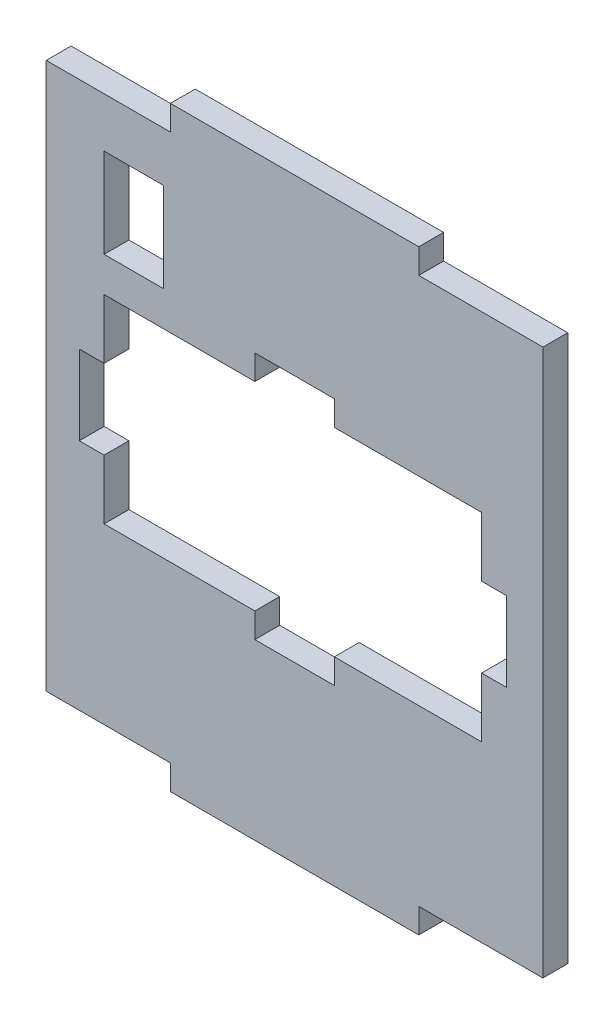
ISO-10303-21;
HEADER;
FILE_DESCRIPTION(('STEP AP214'),'2;1');
FILE_NAME('part.step','',(''),(''),'','','');
FILE_SCHEMA(('AUTOMOTIVE_DESIGN { 1 0 10303 214 1 1 1 1 }'));
ENDSEC;
DATA;
#1=APPLICATION_CONTEXT('core data for automotive mechanical design processes');
#2=APPLICATION_PROTOCOL_DEFINITION('international standard','automotive_design',2000,#1);
#3=PRODUCT_CONTEXT('',#1,'mechanical');
#4=PRODUCT('Part','Part','',(#3));
#5=PRODUCT_RELATED_PRODUCT_CATEGORY('part','',(#4));
#6=PRODUCT_DEFINITION_FORMATION('','',#4);
#7=PRODUCT_DEFINITION_CONTEXT('part definition',#1,'design');
#8=PRODUCT_DEFINITION('design','',#6,#7);
#9=PRODUCT_DEFINITION_SHAPE('','',#8);
#10=(LENGTH_UNIT() NAMED_UNIT(*) SI_UNIT(.MILLI.,.METRE.));
#11=(NAMED_UNIT(*) PLANE_ANGLE_UNIT() SI_UNIT($,.RADIAN.));
#12=(NAMED_UNIT(*) SI_UNIT($,.STERADIAN.) SOLID_ANGLE_UNIT());
#13=UNCERTAINTY_MEASURE_WITH_UNIT(LENGTH_MEASURE(1.E-05),#10,'distance_accuracy_value','');
#14=(GEOMETRIC_REPRESENTATION_CONTEXT(3) GLOBAL_UNCERTAINTY_ASSIGNED_CONTEXT((#13)) GLOBAL_UNIT_ASSIGNED_CONTEXT((#10,
#11,#12)) REPRESENTATION_CONTEXT('',''));
#15=CARTESIAN_POINT('',(0.,0.,0.));
#16=DIRECTION('',(0.,0.,1.));
#17=DIRECTION('',(1.,0.,0.));
#18=AXIS2_PLACEMENT_3D('',#15,#16,#17);
#19=CARTESIAN_POINT('',(0.,0.,5.));
#20=DIRECTION('',(0.,0.,1.));
#21=DIRECTION('',(1.,0.,0.));
#22=AXIS2_PLACEMENT_3D('',#19,#20,#21);
#23=PLANE('',#22);
#24=DIRECTION('',(0.,1.,0.));
#25=VECTOR('',#24,1.);
#26=CARTESIAN_POINT('',(25.,60.,5.));
#27=LINE('',#26,#25);
#28=CARTESIAN_POINT('',(25.,55.,5.));
#29=VERTEX_POINT('',#28);
#30=CARTESIAN_POINT('',(25.,60.,5.));
#31=VERTEX_POINT('',#30);
#32=EDGE_CURVE('E450',#29,#31,#27,.T.);
#33=ORIENTED_EDGE('',*,*,#32,.T.);
#34=DIRECTION('',(-1.,0.,0.));
#35=VECTOR('',#34,1.);
#36=CARTESIAN_POINT('',(-25.,60.,5.));
#37=LINE('',#36,#35);
#38=CARTESIAN_POINT('',(-25.,60.,5.));
#39=VERTEX_POINT('',#38);
#40=EDGE_CURVE('E453',#31,#39,#37,.T.);
#41=ORIENTED_EDGE('',*,*,#40,.T.);
#42=DIRECTION('',(0.,-1.,0.));
#43=VECTOR('',#42,1.);
#44=CARTESIAN_POINT('',(-25.,55.,5.));
#45=LINE('',#44,#43);
#46=CARTESIAN_POINT('',(-25.,55.,5.));
#47=VERTEX_POINT('',#46);
#48=EDGE_CURVE('E456',#39,#47,#45,.T.);
#49=ORIENTED_EDGE('',*,*,#48,.T.);
#50=DIRECTION('',(-1.,0.,0.));
#51=VECTOR('',#50,1.);
#52=CARTESIAN_POINT('',(-50.,55.,5.));
#53=LINE('',#52,#51);
#54=CARTESIAN_POINT('',(-50.,55.,5.));
#55=VERTEX_POINT('',#54);
#56=EDGE_CURVE('E458',#47,#55,#53,.T.);
#57=ORIENTED_EDGE('',*,*,#56,.T.);
#58=DIRECTION('',(0.,-1.,0.));
#59=VECTOR('',#58,1.);
#60=CARTESIAN_POINT('',(-50.,55.,5.));
#61=LINE('',#60,#59);
#62=CARTESIAN_POINT('',(-50.,-55.,5.));
#63=VERTEX_POINT('',#62);
#64=EDGE_CURVE('E460',#55,#63,#61,.T.);
#65=ORIENTED_EDGE('',*,*,#64,.T.);
#66=DIRECTION('',(1.,0.,0.));
#67=VECTOR('',#66,1.);
#68=CARTESIAN_POINT('',(-50.,-55.,5.));
#69=LINE('',#68,#67);
#70=CARTESIAN_POINT('',(-25.,-55.,5.));
#71=VERTEX_POINT('',#70);
#72=EDGE_CURVE('E462',#63,#71,#69,.T.);
#73=ORIENTED_EDGE('',*,*,#72,.T.);
#74=DIRECTION('',(0.,-1.,0.));
#75=VECTOR('',#74,1.);
#76=CARTESIAN_POINT('',(-25.,-60.,5.));
#77=LINE('',#76,#75);
#78=CARTESIAN_POINT('',(-25.,-60.,5.));
#79=VERTEX_POINT('',#78);
#80=EDGE_CURVE('E464',#71,#79,#77,.T.);
#81=ORIENTED_EDGE('',*,*,#80,.T.);
#82=DIRECTION('',(1.,0.,0.));
#83=VECTOR('',#82,1.);
#84=CARTESIAN_POINT('',(-25.,-60.,5.));
#85=LINE('',#84,#83);
#86=CARTESIAN_POINT('',(25.,-60.,5.));
#87=VERTEX_POINT('',#86);
#88=EDGE_CURVE('E466',#79,#87,#85,.T.);
#89=ORIENTED_EDGE('',*,*,#88,.T.);
#90=DIRECTION('',(0.,1.,0.));
#91=VECTOR('',#90,1.);
#92=CARTESIAN_POINT('',(25.,-55.,5.));
#93=LINE('',#92,#91);
#94=CARTESIAN_POINT('',(25.,-55.,5.));
#95=VERTEX_POINT('',#94);
#96=EDGE_CURVE('E468',#87,#95,#93,.T.);
#97=ORIENTED_EDGE('',*,*,#96,.T.);
#98=DIRECTION('',(1.,0.,0.));
#99=VECTOR('',#98,1.);
#100=CARTESIAN_POINT('',(25.,-55.,5.));
#101=LINE('',#100,#99);
#102=CARTESIAN_POINT('',(50.,-55.,5.));
#103=VERTEX_POINT('',#102);
#104=EDGE_CURVE('E470',#95,#103,#101,.T.);
#105=ORIENTED_EDGE('',*,*,#104,.T.);
#106=DIRECTION('',(0.,1.,0.));
#107=VECTOR('',#106,1.);
#108=CARTESIAN_POINT('',(50.,55.,5.));
#109=LINE('',#108,#107);
#110=CARTESIAN_POINT('',(50.,55.,5.));
#111=VERTEX_POINT('',#110);
#112=EDGE_CURVE('E472',#103,#111,#109,.T.);
#113=ORIENTED_EDGE('',*,*,#112,.T.);
#114=DIRECTION('',(-1.,0.,0.));
#115=VECTOR('',#114,1.);
#116=CARTESIAN_POINT('',(25.,55.,5.));
#117=LINE('',#116,#115);
#118=EDGE_CURVE('E474',#111,#29,#117,.T.);
#119=ORIENTED_EDGE('',*,*,#118,.T.);
#120=EDGE_LOOP('',(#33,#41,#49,#57,#65,#73,#81,#89,#97,#105,#113,#119));
#121=FACE_BOUND('',#120,.T.);
#122=DIRECTION('',(0.,1.,0.));
#123=VECTOR('',#122,1.);
#124=CARTESIAN_POINT('',(37.6511627906977,-8.,5.));
#125=LINE('',#124,#123);
#126=CARTESIAN_POINT('',(37.6511627906977,-20.,5.));
#127=VERTEX_POINT('',#126);
#128=CARTESIAN_POINT('',(37.6511627906977,-8.,5.));
#129=VERTEX_POINT('',#128);
#130=EDGE_CURVE('E309',#127,#129,#125,.T.);
#131=ORIENTED_EDGE('',*,*,#130,.F.);
#132=DIRECTION('',(1.,0.,0.));
#133=VECTOR('',#132,1.);
#134=CARTESIAN_POINT('',(8.00000000000001,-20.,5.));
#135=LINE('',#134,#133);
#136=CARTESIAN_POINT('',(8.00000000000001,-20.,5.));
#137=VERTEX_POINT('',#136);
#138=EDGE_CURVE('E307',#137,#127,#135,.T.);
#139=ORIENTED_EDGE('',*,*,#138,.F.);
#140=DIRECTION('',(0.,1.,0.));
#141=VECTOR('',#140,1.);
#142=CARTESIAN_POINT('',(8.,-25.,5.));
#143=LINE('',#142,#141);
#144=CARTESIAN_POINT('',(8.,-25.,5.));
#145=VERTEX_POINT('',#144);
#146=EDGE_CURVE('E347',#145,#137,#143,.T.);
#147=ORIENTED_EDGE('',*,*,#146,.F.);
#148=DIRECTION('',(1.,0.,0.));
#149=VECTOR('',#148,1.);
#150=CARTESIAN_POINT('',(-8.,-25.,5.));
#151=LINE('',#150,#149);
#152=CARTESIAN_POINT('',(-8.,-25.,5.));
#153=VERTEX_POINT('',#152);
#154=EDGE_CURVE('E344',#153,#145,#151,.T.);
#155=ORIENTED_EDGE('',*,*,#154,.F.);
#156=DIRECTION('',(0.,-1.,0.));
#157=VECTOR('',#156,1.);
#158=CARTESIAN_POINT('',(-8.,-20.,5.));
#159=LINE('',#158,#157);
#160=CARTESIAN_POINT('',(-8.,-20.,5.));
#161=VERTEX_POINT('',#160);
#162=EDGE_CURVE('E342',#161,#153,#159,.T.);
#163=ORIENTED_EDGE('',*,*,#162,.F.);
#164=DIRECTION('',(1.,0.,0.));
#165=VECTOR('',#164,1.);
#166=CARTESIAN_POINT('',(-38.3488372093023,-20.,5.));
#167=LINE('',#166,#165);
#168=CARTESIAN_POINT('',(-38.3488372093023,-20.,5.));
#169=VERTEX_POINT('',#168);
#170=EDGE_CURVE('E340',#169,#161,#167,.T.);
#171=ORIENTED_EDGE('',*,*,#170,.F.);
#172=DIRECTION('',(0.,-1.,0.));
#173=VECTOR('',#172,1.);
#174=CARTESIAN_POINT('',(-38.3488372093023,-8.,5.));
#175=LINE('',#174,#173);
#176=CARTESIAN_POINT('',(-38.3488372093023,-8.,5.));
#177=VERTEX_POINT('',#176);
#178=EDGE_CURVE('E338',#177,#169,#175,.T.);
#179=ORIENTED_EDGE('',*,*,#178,.F.);
#180=DIRECTION('',(1.,0.,0.));
#181=VECTOR('',#180,1.);
#182=CARTESIAN_POINT('',(-43.3488372093023,-8.,5.));
#183=LINE('',#182,#181);
#184=CARTESIAN_POINT('',(-43.3488372093023,-8.,5.));
#185=VERTEX_POINT('',#184);
#186=EDGE_CURVE('E336',#185,#177,#183,.T.);
#187=ORIENTED_EDGE('',*,*,#186,.F.);
#188=DIRECTION('',(0.,-1.,0.));
#189=VECTOR('',#188,1.);
#190=CARTESIAN_POINT('',(-43.3488372093023,8.,5.));
#191=LINE('',#190,#189);
#192=CARTESIAN_POINT('',(-43.3488372093023,8.,5.));
#193=VERTEX_POINT('',#192);
#194=EDGE_CURVE('E334',#193,#185,#191,.T.);
#195=ORIENTED_EDGE('',*,*,#194,.F.);
#196=DIRECTION('',(-1.,0.,0.));
#197=VECTOR('',#196,1.);
#198=CARTESIAN_POINT('',(-38.3488372093023,8.,5.));
#199=LINE('',#198,#197);
#200=CARTESIAN_POINT('',(-38.3488372093023,8.,5.));
#201=VERTEX_POINT('',#200);
#202=EDGE_CURVE('E332',#201,#193,#199,.T.);
#203=ORIENTED_EDGE('',*,*,#202,.F.);
#204=DIRECTION('',(0.,-1.,0.));
#205=VECTOR('',#204,1.);
#206=CARTESIAN_POINT('',(-38.3488372093023,20.,5.));
#207=LINE('',#206,#205);
#208=CARTESIAN_POINT('',(-38.3488372093023,20.,5.));
#209=VERTEX_POINT('',#208);
#210=EDGE_CURVE('E330',#209,#201,#207,.T.);
#211=ORIENTED_EDGE('',*,*,#210,.F.);
#212=DIRECTION('',(-1.,0.,0.));
#213=VECTOR('',#212,1.);
#214=CARTESIAN_POINT('',(-38.3488372093023,20.,5.));
#215=LINE('',#214,#213);
#216=CARTESIAN_POINT('',(-8.,20.,5.));
#217=VERTEX_POINT('',#216);
#218=EDGE_CURVE('E328',#217,#209,#215,.T.);
#219=ORIENTED_EDGE('',*,*,#218,.F.);
#220=DIRECTION('',(0.,-1.,0.));
#221=VECTOR('',#220,1.);
#222=CARTESIAN_POINT('',(-8.,20.,5.));
#223=LINE('',#222,#221);
#224=CARTESIAN_POINT('',(-8.,25.,5.));
#225=VERTEX_POINT('',#224);
#226=EDGE_CURVE('E326',#225,#217,#223,.T.);
#227=ORIENTED_EDGE('',*,*,#226,.F.);
#228=DIRECTION('',(-1.,0.,0.));
#229=VECTOR('',#228,1.);
#230=CARTESIAN_POINT('',(-8.,25.,5.));
#231=LINE('',#230,#229);
#232=CARTESIAN_POINT('',(8.00000000000001,25.,5.));
#233=VERTEX_POINT('',#232);
#234=EDGE_CURVE('E324',#233,#225,#231,.T.);
#235=ORIENTED_EDGE('',*,*,#234,.F.);
#236=DIRECTION('',(0.,1.,0.));
#237=VECTOR('',#236,1.);
#238=CARTESIAN_POINT('',(8.00000000000001,25.,5.));
#239=LINE('',#238,#237);
#240=CARTESIAN_POINT('',(8.00000000000001,20.,5.));
#241=VERTEX_POINT('',#240);
#242=EDGE_CURVE('E322',#241,#233,#239,.T.);
#243=ORIENTED_EDGE('',*,*,#242,.F.);
#244=DIRECTION('',(-1.,0.,0.));
#245=VECTOR('',#244,1.);
#246=CARTESIAN_POINT('',(8.00000000000001,20.,5.));
#247=LINE('',#246,#245);
#248=CARTESIAN_POINT('',(37.6511627906977,20.,5.));
#249=VERTEX_POINT('',#248);
#250=EDGE_CURVE('E320',#249,#241,#247,.T.);
#251=ORIENTED_EDGE('',*,*,#250,.F.);
#252=DIRECTION('',(0.,1.,0.));
#253=VECTOR('',#252,1.);
#254=CARTESIAN_POINT('',(37.6511627906977,20.,5.));
#255=LINE('',#254,#253);
#256=CARTESIAN_POINT('',(37.6511627906977,8.,5.));
#257=VERTEX_POINT('',#256);
#258=EDGE_CURVE('E318',#257,#249,#255,.T.);
#259=ORIENTED_EDGE('',*,*,#258,.F.);
#260=DIRECTION('',(-1.,0.,0.));
#261=VECTOR('',#260,1.);
#262=CARTESIAN_POINT('',(37.6511627906977,8.,5.));
#263=LINE('',#262,#261);
#264=CARTESIAN_POINT('',(42.6511627906977,8.,5.));
#265=VERTEX_POINT('',#264);
#266=EDGE_CURVE('E316',#265,#257,#263,.T.);
#267=ORIENTED_EDGE('',*,*,#266,.F.);
#268=DIRECTION('',(0.,1.,0.));
#269=VECTOR('',#268,1.);
#270=CARTESIAN_POINT('',(42.6511627906977,8.,5.));
#271=LINE('',#270,#269);
#272=CARTESIAN_POINT('',(42.6511627906977,-8.,5.));
#273=VERTEX_POINT('',#272);
#274=EDGE_CURVE('E314',#273,#265,#271,.T.);
#275=ORIENTED_EDGE('',*,*,#274,.F.);
#276=DIRECTION('',(1.,0.,0.));
#277=VECTOR('',#276,1.);
#278=CARTESIAN_POINT('',(42.6511627906977,-8.,5.));
#279=LINE('',#278,#277);
#280=EDGE_CURVE('E312',#129,#273,#279,.T.);
#281=ORIENTED_EDGE('',*,*,#280,.F.);
#282=EDGE_LOOP('',(#131,#139,#147,#155,#163,#171,#179,#187,#195,#203,#211,#219,#227,#235,#243,
#251,#259,#267,#275,#281));
#283=FACE_BOUND('',#282,.T.);
#284=DIRECTION('',(0.,-1.,0.));
#285=VECTOR('',#284,1.);
#286=CARTESIAN_POINT('',(-38.3488372093023,45.,5.));
#287=LINE('',#286,#285);
#288=CARTESIAN_POINT('',(-38.3488372093023,45.,5.));
#289=VERTEX_POINT('',#288);
#290=CARTESIAN_POINT('',(-38.3488372093023,27.,5.));
#291=VERTEX_POINT('',#290);
#292=EDGE_CURVE('E279',#289,#291,#287,.T.);
#293=ORIENTED_EDGE('',*,*,#292,.F.);
#294=DIRECTION('',(-1.,0.,0.));
#295=VECTOR('',#294,1.);
#296=CARTESIAN_POINT('',(-26.3488372093023,45.,5.));
#297=LINE('',#296,#295);
#298=CARTESIAN_POINT('',(-26.3488372093023,45.,5.));
#299=VERTEX_POINT('',#298);
#300=EDGE_CURVE('E271',#299,#289,#297,.T.);
#301=ORIENTED_EDGE('',*,*,#300,.F.);
#302=DIRECTION('',(0.,1.,0.));
#303=VECTOR('',#302,1.);
#304=CARTESIAN_POINT('',(-26.3488372093023,27.,5.));
#305=LINE('',#304,#303);
#306=CARTESIAN_POINT('',(-26.3488372093023,27.,5.));
#307=VERTEX_POINT('',#306);
#308=EDGE_CURVE('E293',#307,#299,#305,.T.);
#309=ORIENTED_EDGE('',*,*,#308,.F.);
#310=DIRECTION('',(1.,0.,0.));
#311=VECTOR('',#310,1.);
#312=CARTESIAN_POINT('',(-38.3488372093023,27.,5.));
#313=LINE('',#312,#311);
#314=EDGE_CURVE('E291',#291,#307,#313,.T.);
#315=ORIENTED_EDGE('',*,*,#314,.F.);
#316=EDGE_LOOP('',(#293,#301,#309,#315));
#317=FACE_BOUND('',#316,.T.);
#318=ADVANCED_FACE('F38',(#121,#283,#317),#23,.T.);
#319=CARTESIAN_POINT('',(0.,0.,0.));
#320=DIRECTION('',(0.,0.,1.));
#321=DIRECTION('',(1.,0.,0.));
#322=AXIS2_PLACEMENT_3D('',#319,#320,#321);
#323=PLANE('',#322);
#324=DIRECTION('',(1.,0.,0.));
#325=VECTOR('',#324,1.);
#326=CARTESIAN_POINT('',(8.00000000000001,-20.,0.));
#327=LINE('',#326,#325);
#328=CARTESIAN_POINT('',(8.00000000000001,-20.,0.));
#329=VERTEX_POINT('',#328);
#330=CARTESIAN_POINT('',(37.6511627906977,-20.,0.));
#331=VERTEX_POINT('',#330);
#332=EDGE_CURVE('E287',#329,#331,#327,.T.);
#333=ORIENTED_EDGE('',*,*,#332,.T.);
#334=DIRECTION('',(0.,1.,0.));
#335=VECTOR('',#334,1.);
#336=CARTESIAN_POINT('',(37.6511627906977,-8.,0.));
#337=LINE('',#336,#335);
#338=CARTESIAN_POINT('',(37.6511627906977,-8.,0.));
#339=VERTEX_POINT('',#338);
#340=EDGE_CURVE('E352',#331,#339,#337,.T.);
#341=ORIENTED_EDGE('',*,*,#340,.T.);
#342=DIRECTION('',(1.,0.,0.));
#343=VECTOR('',#342,1.);
#344=CARTESIAN_POINT('',(42.6511627906977,-8.,0.));
#345=LINE('',#344,#343);
#346=CARTESIAN_POINT('',(42.6511627906977,-8.,0.));
#347=VERTEX_POINT('',#346);
#348=EDGE_CURVE('E355',#339,#347,#345,.T.);
#349=ORIENTED_EDGE('',*,*,#348,.T.);
#350=DIRECTION('',(0.,1.,0.));
#351=VECTOR('',#350,1.);
#352=CARTESIAN_POINT('',(42.6511627906977,8.,0.));
#353=LINE('',#352,#351);
#354=CARTESIAN_POINT('',(42.6511627906977,8.,0.));
#355=VERTEX_POINT('',#354);
#356=EDGE_CURVE('E358',#347,#355,#353,.T.);
#357=ORIENTED_EDGE('',*,*,#356,.T.);
#358=DIRECTION('',(-1.,0.,0.));
#359=VECTOR('',#358,1.);
#360=CARTESIAN_POINT('',(37.6511627906977,8.,0.));
#361=LINE('',#360,#359);
#362=CARTESIAN_POINT('',(37.6511627906977,8.,0.));
#363=VERTEX_POINT('',#362);
#364=EDGE_CURVE('E361',#355,#363,#361,.T.);
#365=ORIENTED_EDGE('',*,*,#364,.T.);
#366=DIRECTION('',(0.,1.,0.));
#367=VECTOR('',#366,1.);
#368=CARTESIAN_POINT('',(37.6511627906977,20.,0.));
#369=LINE('',#368,#367);
#370=CARTESIAN_POINT('',(37.6511627906977,20.,0.));
#371=VERTEX_POINT('',#370);
#372=EDGE_CURVE('E364',#363,#371,#369,.T.);
#373=ORIENTED_EDGE('',*,*,#372,.T.);
#374=DIRECTION('',(-1.,0.,0.));
#375=VECTOR('',#374,1.);
#376=CARTESIAN_POINT('',(8.00000000000001,20.,0.));
#377=LINE('',#376,#375);
#378=CARTESIAN_POINT('',(8.00000000000001,20.,0.));
#379=VERTEX_POINT('',#378);
#380=EDGE_CURVE('E367',#371,#379,#377,.T.);
#381=ORIENTED_EDGE('',*,*,#380,.T.);
#382=DIRECTION('',(0.,1.,0.));
#383=VECTOR('',#382,1.);
#384=CARTESIAN_POINT('',(8.00000000000001,25.,0.));
#385=LINE('',#384,#383);
#386=CARTESIAN_POINT('',(8.00000000000001,25.,0.));
#387=VERTEX_POINT('',#386);
#388=EDGE_CURVE('E370',#379,#387,#385,.T.);
#389=ORIENTED_EDGE('',*,*,#388,.T.);
#390=DIRECTION('',(-1.,0.,0.));
#391=VECTOR('',#390,1.);
#392=CARTESIAN_POINT('',(-8.,25.,0.));
#393=LINE('',#392,#391);
#394=CARTESIAN_POINT('',(-8.,25.,0.));
#395=VERTEX_POINT('',#394);
#396=EDGE_CURVE('E373',#387,#395,#393,.T.);
#397=ORIENTED_EDGE('',*,*,#396,.T.);
#398=DIRECTION('',(0.,-1.,0.));
#399=VECTOR('',#398,1.);
#400=CARTESIAN_POINT('',(-8.,20.,0.));
#401=LINE('',#400,#399);
#402=CARTESIAN_POINT('',(-8.,20.,0.));
#403=VERTEX_POINT('',#402);
#404=EDGE_CURVE('E376',#395,#403,#401,.T.);
#405=ORIENTED_EDGE('',*,*,#404,.T.);
#406=DIRECTION('',(-1.,0.,0.));
#407=VECTOR('',#406,1.);
#408=CARTESIAN_POINT('',(-38.3488372093023,20.,0.));
#409=LINE('',#408,#407);
#410=CARTESIAN_POINT('',(-38.3488372093023,20.,0.));
#411=VERTEX_POINT('',#410);
#412=EDGE_CURVE('E379',#403,#411,#409,.T.);
#413=ORIENTED_EDGE('',*,*,#412,.T.);
#414=DIRECTION('',(0.,-1.,0.));
#415=VECTOR('',#414,1.);
#416=CARTESIAN_POINT('',(-38.3488372093023,20.,0.));
#417=LINE('',#416,#415);
#418=CARTESIAN_POINT('',(-38.3488372093023,8.,0.));
#419=VERTEX_POINT('',#418);
#420=EDGE_CURVE('E382',#411,#419,#417,.T.);
#421=ORIENTED_EDGE('',*,*,#420,.T.);
#422=DIRECTION('',(-1.,0.,0.));
#423=VECTOR('',#422,1.);
#424=CARTESIAN_POINT('',(-38.3488372093023,8.,0.));
#425=LINE('',#424,#423);
#426=CARTESIAN_POINT('',(-43.3488372093023,8.,0.));
#427=VERTEX_POINT('',#426);
#428=EDGE_CURVE('E385',#419,#427,#425,.T.);
#429=ORIENTED_EDGE('',*,*,#428,.T.);
#430=DIRECTION('',(0.,-1.,0.));
#431=VECTOR('',#430,1.);
#432=CARTESIAN_POINT('',(-43.3488372093023,8.,0.));
#433=LINE('',#432,#431);
#434=CARTESIAN_POINT('',(-43.3488372093023,-8.,0.));
#435=VERTEX_POINT('',#434);
#436=EDGE_CURVE('E388',#427,#435,#433,.T.);
#437=ORIENTED_EDGE('',*,*,#436,.T.);
#438=DIRECTION('',(1.,0.,0.));
#439=VECTOR('',#438,1.);
#440=CARTESIAN_POINT('',(-43.3488372093023,-8.,0.));
#441=LINE('',#440,#439);
#442=CARTESIAN_POINT('',(-38.3488372093023,-8.,0.));
#443=VERTEX_POINT('',#442);
#444=EDGE_CURVE('E391',#435,#443,#441,.T.);
#445=ORIENTED_EDGE('',*,*,#444,.T.);
#446=DIRECTION('',(0.,-1.,0.));
#447=VECTOR('',#446,1.);
#448=CARTESIAN_POINT('',(-38.3488372093023,-8.,0.));
#449=LINE('',#448,#447);
#450=CARTESIAN_POINT('',(-38.3488372093023,-20.,0.));
#451=VERTEX_POINT('',#450);
#452=EDGE_CURVE('E394',#443,#451,#449,.T.);
#453=ORIENTED_EDGE('',*,*,#452,.T.);
#454=DIRECTION('',(1.,0.,0.));
#455=VECTOR('',#454,1.);
#456=CARTESIAN_POINT('',(-38.3488372093023,-20.,0.));
#457=LINE('',#456,#455);
#458=CARTESIAN_POINT('',(-8.,-20.,0.));
#459=VERTEX_POINT('',#458);
#460=EDGE_CURVE('E397',#451,#459,#457,.T.);
#461=ORIENTED_EDGE('',*,*,#460,.T.);
#462=DIRECTION('',(0.,-1.,0.));
#463=VECTOR('',#462,1.);
#464=CARTESIAN_POINT('',(-8.,-20.,0.));
#465=LINE('',#464,#463);
#466=CARTESIAN_POINT('',(-8.,-25.,0.));
#467=VERTEX_POINT('',#466);
#468=EDGE_CURVE('E400',#459,#467,#465,.T.);
#469=ORIENTED_EDGE('',*,*,#468,.T.);
#470=DIRECTION('',(1.,0.,0.));
#471=VECTOR('',#470,1.);
#472=CARTESIAN_POINT('',(-8.,-25.,0.));
#473=LINE('',#472,#471);
#474=CARTESIAN_POINT('',(8.,-25.,0.));
#475=VERTEX_POINT('',#474);
#476=EDGE_CURVE('E403',#467,#475,#473,.T.);
#477=ORIENTED_EDGE('',*,*,#476,.T.);
#478=DIRECTION('',(0.,1.,0.));
#479=VECTOR('',#478,1.);
#480=CARTESIAN_POINT('',(8.,-25.,0.));
#481=LINE('',#480,#479);
#482=EDGE_CURVE('E310',#475,#329,#481,.T.);
#483=ORIENTED_EDGE('',*,*,#482,.T.);
#484=EDGE_LOOP('',(#333,#341,#349,#357,#365,#373,#381,#389,#397,#405,#413,#421,#429,#437,#445,
#453,#461,#469,#477,#483));
#485=FACE_BOUND('',#484,.T.);
#486=DIRECTION('',(0.,1.,0.));
#487=VECTOR('',#486,1.);
#488=CARTESIAN_POINT('',(25.,60.,0.));
#489=LINE('',#488,#487);
#490=CARTESIAN_POINT('',(25.,55.,0.));
#491=VERTEX_POINT('',#490);
#492=CARTESIAN_POINT('',(25.,60.,0.));
#493=VERTEX_POINT('',#492);
#494=EDGE_CURVE('E449',#491,#493,#489,.T.);
#495=ORIENTED_EDGE('',*,*,#494,.F.);
#496=DIRECTION('',(-1.,0.,0.));
#497=VECTOR('',#496,1.);
#498=CARTESIAN_POINT('',(25.,55.,0.));
#499=LINE('',#498,#497);
#500=CARTESIAN_POINT('',(50.,55.,0.));
#501=VERTEX_POINT('',#500);
#502=EDGE_CURVE('E454',#501,#491,#499,.T.);
#503=ORIENTED_EDGE('',*,*,#502,.F.);
#504=DIRECTION('',(0.,1.,0.));
#505=VECTOR('',#504,1.);
#506=CARTESIAN_POINT('',(50.,55.,0.));
#507=LINE('',#506,#505);
#508=CARTESIAN_POINT('',(50.,-55.,0.));
#509=VERTEX_POINT('',#508);
#510=EDGE_CURVE('E497',#509,#501,#507,.T.);
#511=ORIENTED_EDGE('',*,*,#510,.F.);
#512=DIRECTION('',(1.,0.,0.));
#513=VECTOR('',#512,1.);
#514=CARTESIAN_POINT('',(25.,-55.,0.));
#515=LINE('',#514,#513);
#516=CARTESIAN_POINT('',(25.,-55.,0.));
#517=VERTEX_POINT('',#516);
#518=EDGE_CURVE('E495',#517,#509,#515,.T.);
#519=ORIENTED_EDGE('',*,*,#518,.F.);
#520=DIRECTION('',(0.,1.,0.));
#521=VECTOR('',#520,1.);
#522=CARTESIAN_POINT('',(25.,-55.,0.));
#523=LINE('',#522,#521);
#524=CARTESIAN_POINT('',(25.,-60.,0.));
#525=VERTEX_POINT('',#524);
#526=EDGE_CURVE('E493',#525,#517,#523,.T.);
#527=ORIENTED_EDGE('',*,*,#526,.F.);
#528=DIRECTION('',(1.,0.,0.));
#529=VECTOR('',#528,1.);
#530=CARTESIAN_POINT('',(-25.,-60.,0.));
#531=LINE('',#530,#529);
#532=CARTESIAN_POINT('',(-25.,-60.,0.));
#533=VERTEX_POINT('',#532);
#534=EDGE_CURVE('E491',#533,#525,#531,.T.);
#535=ORIENTED_EDGE('',*,*,#534,.F.);
#536=DIRECTION('',(0.,-1.,0.));
#537=VECTOR('',#536,1.);
#538=CARTESIAN_POINT('',(-25.,-60.,0.));
#539=LINE('',#538,#537);
#540=CARTESIAN_POINT('',(-25.,-55.,0.));
#541=VERTEX_POINT('',#540);
#542=EDGE_CURVE('E489',#541,#533,#539,.T.);
#543=ORIENTED_EDGE('',*,*,#542,.F.);
#544=DIRECTION('',(1.,0.,0.));
#545=VECTOR('',#544,1.);
#546=CARTESIAN_POINT('',(-50.,-55.,0.));
#547=LINE('',#546,#545);
#548=CARTESIAN_POINT('',(-50.,-55.,0.));
#549=VERTEX_POINT('',#548);
#550=EDGE_CURVE('E487',#549,#541,#547,.T.);
#551=ORIENTED_EDGE('',*,*,#550,.F.);
#552=DIRECTION('',(0.,-1.,0.));
#553=VECTOR('',#552,1.);
#554=CARTESIAN_POINT('',(-50.,55.,0.));
#555=LINE('',#554,#553);
#556=CARTESIAN_POINT('',(-50.,55.,0.));
#557=VERTEX_POINT('',#556);
#558=EDGE_CURVE('E485',#557,#549,#555,.T.);
#559=ORIENTED_EDGE('',*,*,#558,.F.);
#560=DIRECTION('',(-1.,0.,0.));
#561=VECTOR('',#560,1.);
#562=CARTESIAN_POINT('',(-50.,55.,0.));
#563=LINE('',#562,#561);
#564=CARTESIAN_POINT('',(-25.,55.,0.));
#565=VERTEX_POINT('',#564);
#566=EDGE_CURVE('E483',#565,#557,#563,.T.);
#567=ORIENTED_EDGE('',*,*,#566,.F.);
#568=DIRECTION('',(0.,-1.,0.));
#569=VECTOR('',#568,1.);
#570=CARTESIAN_POINT('',(-25.,55.,0.));
#571=LINE('',#570,#569);
#572=CARTESIAN_POINT('',(-25.,60.,0.));
#573=VERTEX_POINT('',#572);
#574=EDGE_CURVE('E481',#573,#565,#571,.T.);
#575=ORIENTED_EDGE('',*,*,#574,.F.);
#576=DIRECTION('',(-1.,0.,0.));
#577=VECTOR('',#576,1.);
#578=CARTESIAN_POINT('',(-25.,60.,0.));
#579=LINE('',#578,#577);
#580=EDGE_CURVE('E479',#493,#573,#579,.T.);
#581=ORIENTED_EDGE('',*,*,#580,.F.);
#582=EDGE_LOOP('',(#495,#503,#511,#519,#527,#535,#543,#551,#559,#567,#575,#581));
#583=FACE_BOUND('',#582,.T.);
#584=DIRECTION('',(-1.,0.,0.));
#585=VECTOR('',#584,1.);
#586=CARTESIAN_POINT('',(-26.3488372093023,45.,0.));
#587=LINE('',#586,#585);
#588=CARTESIAN_POINT('',(-26.3488372093023,45.,0.));
#589=VERTEX_POINT('',#588);
#590=CARTESIAN_POINT('',(-38.3488372093023,45.,0.));
#591=VERTEX_POINT('',#590);
#592=EDGE_CURVE('E61',#589,#591,#587,.T.);
#593=ORIENTED_EDGE('',*,*,#592,.T.);
#594=DIRECTION('',(0.,-1.,0.));
#595=VECTOR('',#594,1.);
#596=CARTESIAN_POINT('',(-38.3488372093023,45.,0.));
#597=LINE('',#596,#595);
#598=CARTESIAN_POINT('',(-38.3488372093023,27.,0.));
#599=VERTEX_POINT('',#598);
#600=EDGE_CURVE('E286',#591,#599,#597,.T.);
#601=ORIENTED_EDGE('',*,*,#600,.T.);
#602=DIRECTION('',(1.,0.,0.));
#603=VECTOR('',#602,1.);
#604=CARTESIAN_POINT('',(-38.3488372093023,27.,0.));
#605=LINE('',#604,#603);
#606=CARTESIAN_POINT('',(-26.3488372093023,27.,0.));
#607=VERTEX_POINT('',#606);
#608=EDGE_CURVE('E299',#599,#607,#605,.T.);
#609=ORIENTED_EDGE('',*,*,#608,.T.);
#610=DIRECTION('',(0.,1.,0.));
#611=VECTOR('',#610,1.);
#612=CARTESIAN_POINT('',(-26.3488372093023,27.,0.));
#613=LINE('',#612,#611);
#614=EDGE_CURVE('E280',#607,#589,#613,.T.);
#615=ORIENTED_EDGE('',*,*,#614,.T.);
#616=EDGE_LOOP('',(#593,#601,#609,#615));
#617=FACE_BOUND('',#616,.T.);
#618=ADVANCED_FACE('F539',(#485,#583,#617),#323,.F.);
#619=CARTESIAN_POINT('',(25.,60.,5.));
#620=DIRECTION('',(-1.,0.,0.));
#621=DIRECTION('',(0.,-1.,0.));
#622=AXIS2_PLACEMENT_3D('',#619,#620,#621);
#623=PLANE('',#622);
#624=ORIENTED_EDGE('',*,*,#494,.T.);
#625=DIRECTION('',(0.,0.,-1.));
#626=VECTOR('',#625,1.);
#627=CARTESIAN_POINT('',(25.,60.,5.));
#628=LINE('',#627,#626);
#629=EDGE_CURVE('E11',#31,#493,#628,.T.);
#630=ORIENTED_EDGE('',*,*,#629,.F.);
#631=ORIENTED_EDGE('',*,*,#32,.F.);
#632=DIRECTION('',(0.,0.,-1.));
#633=VECTOR('',#632,1.);
#634=CARTESIAN_POINT('',(25.,55.,5.));
#635=LINE('',#634,#633);
#636=EDGE_CURVE('E476',#29,#491,#635,.T.);
#637=ORIENTED_EDGE('',*,*,#636,.T.);
#638=EDGE_LOOP('',(#624,#630,#631,#637));
#639=FACE_BOUND('',#638,.T.);
#640=ADVANCED_FACE('F40',(#639),#623,.F.);
#641=CARTESIAN_POINT('',(-25.,60.,5.));
#642=DIRECTION('',(0.,-1.,0.));
#643=DIRECTION('',(1.,0.,0.));
#644=AXIS2_PLACEMENT_3D('',#641,#642,#643);
#645=PLANE('',#644);
#646=ORIENTED_EDGE('',*,*,#580,.T.);
#647=DIRECTION('',(0.,0.,-1.));
#648=VECTOR('',#647,1.);
#649=CARTESIAN_POINT('',(-25.,60.,5.));
#650=LINE('',#649,#648);
#651=EDGE_CURVE('E46',#39,#573,#650,.T.);
#652=ORIENTED_EDGE('',*,*,#651,.F.);
#653=ORIENTED_EDGE('',*,*,#40,.F.);
#654=ORIENTED_EDGE('',*,*,#629,.T.);
#655=EDGE_LOOP('',(#646,#652,#653,#654));
#656=FACE_BOUND('',#655,.T.);
#657=ADVANCED_FACE('F557',(#656),#645,.F.);
#658=CARTESIAN_POINT('',(-25.,55.,5.));
#659=DIRECTION('',(1.,0.,0.));
#660=DIRECTION('',(0.,1.,0.));
#661=AXIS2_PLACEMENT_3D('',#658,#659,#660);
#662=PLANE('',#661);
#663=ORIENTED_EDGE('',*,*,#574,.T.);
#664=DIRECTION('',(0.,0.,-1.));
#665=VECTOR('',#664,1.);
#666=CARTESIAN_POINT('',(-25.,55.,5.));
#667=LINE('',#666,#665);
#668=EDGE_CURVE('E526',#47,#565,#667,.T.);
#669=ORIENTED_EDGE('',*,*,#668,.F.);
#670=ORIENTED_EDGE('',*,*,#48,.F.);
#671=ORIENTED_EDGE('',*,*,#651,.T.);
#672=EDGE_LOOP('',(#663,#669,#670,#671));
#673=FACE_BOUND('',#672,.T.);
#674=ADVANCED_FACE('F533',(#673),#662,.F.);
#675=CARTESIAN_POINT('',(-50.,55.,5.));
#676=DIRECTION('',(0.,-1.,0.));
#677=DIRECTION('',(1.,0.,0.));
#678=AXIS2_PLACEMENT_3D('',#675,#676,#677);
#679=PLANE('',#678);
#680=ORIENTED_EDGE('',*,*,#566,.T.);
#681=DIRECTION('',(0.,0.,-1.));
#682=VECTOR('',#681,1.);
#683=CARTESIAN_POINT('',(-50.,55.,5.));
#684=LINE('',#683,#682);
#685=EDGE_CURVE('E523',#55,#557,#684,.T.);
#686=ORIENTED_EDGE('',*,*,#685,.F.);
#687=ORIENTED_EDGE('',*,*,#56,.F.);
#688=ORIENTED_EDGE('',*,*,#668,.T.);
#689=EDGE_LOOP('',(#680,#686,#687,#688));
#690=FACE_BOUND('',#689,.T.);
#691=ADVANCED_FACE('F545',(#690),#679,.F.);
#692=CARTESIAN_POINT('',(-50.,55.,5.));
#693=DIRECTION('',(1.,0.,0.));
#694=DIRECTION('',(0.,0.,-1.));
#695=AXIS2_PLACEMENT_3D('',#692,#693,#694);
#696=PLANE('',#695);
#697=ORIENTED_EDGE('',*,*,#558,.T.);
#698=DIRECTION('',(0.,0.,-1.));
#699=VECTOR('',#698,1.);
#700=CARTESIAN_POINT('',(-50.,-55.,5.));
#701=LINE('',#700,#699);
#702=EDGE_CURVE('E520',#63,#549,#701,.T.);
#703=ORIENTED_EDGE('',*,*,#702,.F.);
#704=ORIENTED_EDGE('',*,*,#64,.F.);
#705=ORIENTED_EDGE('',*,*,#685,.T.);
#706=EDGE_LOOP('',(#697,#703,#704,#705));
#707=FACE_BOUND('',#706,.T.);
#708=ADVANCED_FACE('F549',(#707),#696,.F.);
#709=CARTESIAN_POINT('',(-50.,-55.,5.));
#710=DIRECTION('',(0.,1.,0.));
#711=DIRECTION('',(-1.,0.,0.));
#712=AXIS2_PLACEMENT_3D('',#709,#710,#711);
#713=PLANE('',#712);
#714=ORIENTED_EDGE('',*,*,#550,.T.);
#715=DIRECTION('',(0.,0.,-1.));
#716=VECTOR('',#715,1.);
#717=CARTESIAN_POINT('',(-25.,-55.,5.));
#718=LINE('',#717,#716);
#719=EDGE_CURVE('E517',#71,#541,#718,.T.);
#720=ORIENTED_EDGE('',*,*,#719,.F.);
#721=ORIENTED_EDGE('',*,*,#72,.F.);
#722=ORIENTED_EDGE('',*,*,#702,.T.);
#723=EDGE_LOOP('',(#714,#720,#721,#722));
#724=FACE_BOUND('',#723,.T.);
#725=ADVANCED_FACE('F590',(#724),#713,.F.);
#726=CARTESIAN_POINT('',(-25.,-60.,5.));
#727=DIRECTION('',(1.,0.,0.));
#728=DIRECTION('',(0.,0.,-1.));
#729=AXIS2_PLACEMENT_3D('',#726,#727,#728);
#730=PLANE('',#729);
#731=ORIENTED_EDGE('',*,*,#542,.T.);
#732=DIRECTION('',(0.,0.,-1.));
#733=VECTOR('',#732,1.);
#734=CARTESIAN_POINT('',(-25.,-60.,5.));
#735=LINE('',#734,#733);
#736=EDGE_CURVE('E514',#79,#533,#735,.T.);
#737=ORIENTED_EDGE('',*,*,#736,.F.);
#738=ORIENTED_EDGE('',*,*,#80,.F.);
#739=ORIENTED_EDGE('',*,*,#719,.T.);
#740=EDGE_LOOP('',(#731,#737,#738,#739));
#741=FACE_BOUND('',#740,.T.);
#742=ADVANCED_FACE('F588',(#741),#730,.F.);
#743=CARTESIAN_POINT('',(-25.,-60.,5.));
#744=DIRECTION('',(0.,1.,0.));
#745=DIRECTION('',(-1.,0.,0.));
#746=AXIS2_PLACEMENT_3D('',#743,#744,#745);
#747=PLANE('',#746);
#748=ORIENTED_EDGE('',*,*,#534,.T.);
#749=DIRECTION('',(0.,0.,-1.));
#750=VECTOR('',#749,1.);
#751=CARTESIAN_POINT('',(25.,-60.,5.));
#752=LINE('',#751,#750);
#753=EDGE_CURVE('E511',#87,#525,#752,.T.);
#754=ORIENTED_EDGE('',*,*,#753,.F.);
#755=ORIENTED_EDGE('',*,*,#88,.F.);
#756=ORIENTED_EDGE('',*,*,#736,.T.);
#757=EDGE_LOOP('',(#748,#754,#755,#756));
#758=FACE_BOUND('',#757,.T.);
#759=ADVANCED_FACE('F584',(#758),#747,.F.);
#760=CARTESIAN_POINT('',(25.,-55.,5.));
#761=DIRECTION('',(-1.,0.,0.));
#762=DIRECTION('',(0.,-1.,0.));
#763=AXIS2_PLACEMENT_3D('',#760,#761,#762);
#764=PLANE('',#763);
#765=ORIENTED_EDGE('',*,*,#526,.T.);
#766=DIRECTION('',(0.,0.,-1.));
#767=VECTOR('',#766,1.);
#768=CARTESIAN_POINT('',(25.,-55.,5.));
#769=LINE('',#768,#767);
#770=EDGE_CURVE('E508',#95,#517,#769,.T.);
#771=ORIENTED_EDGE('',*,*,#770,.F.);
#772=ORIENTED_EDGE('',*,*,#96,.F.);
#773=ORIENTED_EDGE('',*,*,#753,.T.);
#774=EDGE_LOOP('',(#765,#771,#772,#773));
#775=FACE_BOUND('',#774,.T.);
#776=ADVANCED_FACE('F579',(#775),#764,.F.);
#777=CARTESIAN_POINT('',(25.,-55.,5.));
#778=DIRECTION('',(0.,1.,0.));
#779=DIRECTION('',(0.,0.,1.));
#780=AXIS2_PLACEMENT_3D('',#777,#778,#779);
#781=PLANE('',#780);
#782=ORIENTED_EDGE('',*,*,#518,.T.);
#783=DIRECTION('',(0.,0.,-1.));
#784=VECTOR('',#783,1.);
#785=CARTESIAN_POINT('',(50.,-55.,5.));
#786=LINE('',#785,#784);
#787=EDGE_CURVE('E505',#103,#509,#786,.T.);
#788=ORIENTED_EDGE('',*,*,#787,.F.);
#789=ORIENTED_EDGE('',*,*,#104,.F.);
#790=ORIENTED_EDGE('',*,*,#770,.T.);
#791=EDGE_LOOP('',(#782,#788,#789,#790));
#792=FACE_BOUND('',#791,.T.);
#793=ADVANCED_FACE('F573',(#792),#781,.F.);
#794=CARTESIAN_POINT('',(50.,55.,5.));
#795=DIRECTION('',(-1.,0.,0.));
#796=DIRECTION('',(0.,0.,1.));
#797=AXIS2_PLACEMENT_3D('',#794,#795,#796);
#798=PLANE('',#797);
#799=ORIENTED_EDGE('',*,*,#510,.T.);
#800=DIRECTION('',(0.,0.,-1.));
#801=VECTOR('',#800,1.);
#802=CARTESIAN_POINT('',(50.,55.,5.));
#803=LINE('',#802,#801);
#804=EDGE_CURVE('E502',#111,#501,#803,.T.);
#805=ORIENTED_EDGE('',*,*,#804,.F.);
#806=ORIENTED_EDGE('',*,*,#112,.F.);
#807=ORIENTED_EDGE('',*,*,#787,.T.);
#808=EDGE_LOOP('',(#799,#805,#806,#807));
#809=FACE_BOUND('',#808,.T.);
#810=ADVANCED_FACE('F569',(#809),#798,.F.);
#811=CARTESIAN_POINT('',(25.,55.,5.));
#812=DIRECTION('',(0.,-1.,0.));
#813=DIRECTION('',(0.,0.,-1.));
#814=AXIS2_PLACEMENT_3D('',#811,#812,#813);
#815=PLANE('',#814);
#816=ORIENTED_EDGE('',*,*,#502,.T.);
#817=ORIENTED_EDGE('',*,*,#636,.F.);
#818=ORIENTED_EDGE('',*,*,#118,.F.);
#819=ORIENTED_EDGE('',*,*,#804,.T.);
#820=EDGE_LOOP('',(#816,#817,#818,#819));
#821=FACE_BOUND('',#820,.T.);
#822=ADVANCED_FACE('F564',(#821),#815,.F.);
#823=CARTESIAN_POINT('',(8.00000000000001,-20.,5.));
#824=DIRECTION('',(0.,1.,0.));
#825=DIRECTION('',(-1.,0.,0.));
#826=AXIS2_PLACEMENT_3D('',#823,#824,#825);
#827=PLANE('',#826);
#828=ORIENTED_EDGE('',*,*,#332,.F.);
#829=DIRECTION('',(0.,0.,-1.));
#830=VECTOR('',#829,1.);
#831=CARTESIAN_POINT('',(8.00000000000001,-20.,5.));
#832=LINE('',#831,#830);
#833=EDGE_CURVE('E349',#137,#329,#832,.T.);
#834=ORIENTED_EDGE('',*,*,#833,.F.);
#835=ORIENTED_EDGE('',*,*,#138,.T.);
#836=DIRECTION('',(0.,0.,-1.));
#837=VECTOR('',#836,1.);
#838=CARTESIAN_POINT('',(37.6511627906977,-20.,5.));
#839=LINE('',#838,#837);
#840=EDGE_CURVE('E446',#127,#331,#839,.T.);
#841=ORIENTED_EDGE('',*,*,#840,.T.);
#842=EDGE_LOOP('',(#828,#834,#835,#841));
#843=FACE_BOUND('',#842,.T.);
#844=ADVANCED_FACE('F607',(#843),#827,.T.);
#845=CARTESIAN_POINT('',(37.6511627906977,-8.,5.));
#846=DIRECTION('',(-1.,0.,0.));
#847=DIRECTION('',(0.,0.,1.));
#848=AXIS2_PLACEMENT_3D('',#845,#846,#847);
#849=PLANE('',#848);
#850=ORIENTED_EDGE('',*,*,#340,.F.);
#851=ORIENTED_EDGE('',*,*,#840,.F.);
#852=ORIENTED_EDGE('',*,*,#130,.T.);
#853=DIRECTION('',(0.,0.,-1.));
#854=VECTOR('',#853,1.);
#855=CARTESIAN_POINT('',(37.6511627906977,-8.,5.));
#856=LINE('',#855,#854);
#857=EDGE_CURVE('E444',#129,#339,#856,.T.);
#858=ORIENTED_EDGE('',*,*,#857,.T.);
#859=EDGE_LOOP('',(#850,#851,#852,#858));
#860=FACE_BOUND('',#859,.T.);
#861=ADVANCED_FACE('F645',(#860),#849,.T.);
#862=CARTESIAN_POINT('',(42.6511627906977,-8.,5.));
#863=DIRECTION('',(0.,1.,0.));
#864=DIRECTION('',(0.,0.,1.));
#865=AXIS2_PLACEMENT_3D('',#862,#863,#864);
#866=PLANE('',#865);
#867=ORIENTED_EDGE('',*,*,#348,.F.);
#868=ORIENTED_EDGE('',*,*,#857,.F.);
#869=ORIENTED_EDGE('',*,*,#280,.T.);
#870=DIRECTION('',(0.,0.,-1.));
#871=VECTOR('',#870,1.);
#872=CARTESIAN_POINT('',(42.6511627906977,-8.,5.));
#873=LINE('',#872,#871);
#874=EDGE_CURVE('E442',#273,#347,#873,.T.);
#875=ORIENTED_EDGE('',*,*,#874,.T.);
#876=EDGE_LOOP('',(#867,#868,#869,#875));
#877=FACE_BOUND('',#876,.T.);
#878=ADVANCED_FACE('F652',(#877),#866,.T.);
#879=CARTESIAN_POINT('',(42.6511627906977,8.,5.));
#880=DIRECTION('',(-1.,0.,0.));
#881=DIRECTION('',(0.,0.,1.));
#882=AXIS2_PLACEMENT_3D('',#879,#880,#881);
#883=PLANE('',#882);
#884=ORIENTED_EDGE('',*,*,#356,.F.);
#885=ORIENTED_EDGE('',*,*,#874,.F.);
#886=ORIENTED_EDGE('',*,*,#274,.T.);
#887=DIRECTION('',(0.,0.,-1.));
#888=VECTOR('',#887,1.);
#889=CARTESIAN_POINT('',(42.6511627906977,8.,5.));
#890=LINE('',#889,#888);
#891=EDGE_CURVE('E440',#265,#355,#890,.T.);
#892=ORIENTED_EDGE('',*,*,#891,.T.);
#893=EDGE_LOOP('',(#884,#885,#886,#892));
#894=FACE_BOUND('',#893,.T.);
#895=ADVANCED_FACE('F659',(#894),#883,.T.);
#896=CARTESIAN_POINT('',(37.6511627906977,8.,5.));
#897=DIRECTION('',(0.,-1.,0.));
#898=DIRECTION('',(0.,0.,-1.));
#899=AXIS2_PLACEMENT_3D('',#896,#897,#898);
#900=PLANE('',#899);
#901=ORIENTED_EDGE('',*,*,#364,.F.);
#902=ORIENTED_EDGE('',*,*,#891,.F.);
#903=ORIENTED_EDGE('',*,*,#266,.T.);
#904=DIRECTION('',(0.,0.,-1.));
#905=VECTOR('',#904,1.);
#906=CARTESIAN_POINT('',(37.6511627906977,8.,5.));
#907=LINE('',#906,#905);
#908=EDGE_CURVE('E438',#257,#363,#907,.T.);
#909=ORIENTED_EDGE('',*,*,#908,.T.);
#910=EDGE_LOOP('',(#901,#902,#903,#909));
#911=FACE_BOUND('',#910,.T.);
#912=ADVANCED_FACE('F667',(#911),#900,.T.);
#913=CARTESIAN_POINT('',(37.6511627906977,20.,5.));
#914=DIRECTION('',(-1.,0.,0.));
#915=DIRECTION('',(0.,-1.,0.));
#916=AXIS2_PLACEMENT_3D('',#913,#914,#915);
#917=PLANE('',#916);
#918=ORIENTED_EDGE('',*,*,#372,.F.);
#919=ORIENTED_EDGE('',*,*,#908,.F.);
#920=ORIENTED_EDGE('',*,*,#258,.T.);
#921=DIRECTION('',(0.,0.,-1.));
#922=VECTOR('',#921,1.);
#923=CARTESIAN_POINT('',(37.6511627906977,20.,5.));
#924=LINE('',#923,#922);
#925=EDGE_CURVE('E436',#249,#371,#924,.T.);
#926=ORIENTED_EDGE('',*,*,#925,.T.);
#927=EDGE_LOOP('',(#918,#919,#920,#926));
#928=FACE_BOUND('',#927,.T.);
#929=ADVANCED_FACE('F675',(#928),#917,.T.);
#930=CARTESIAN_POINT('',(8.00000000000001,20.,5.));
#931=DIRECTION('',(0.,-1.,0.));
#932=DIRECTION('',(0.,0.,-1.));
#933=AXIS2_PLACEMENT_3D('',#930,#931,#932);
#934=PLANE('',#933);
#935=ORIENTED_EDGE('',*,*,#380,.F.);
#936=ORIENTED_EDGE('',*,*,#925,.F.);
#937=ORIENTED_EDGE('',*,*,#250,.T.);
#938=DIRECTION('',(0.,0.,-1.));
#939=VECTOR('',#938,1.);
#940=CARTESIAN_POINT('',(8.00000000000001,20.,5.));
#941=LINE('',#940,#939);
#942=EDGE_CURVE('E434',#241,#379,#941,.T.);
#943=ORIENTED_EDGE('',*,*,#942,.T.);
#944=EDGE_LOOP('',(#935,#936,#937,#943));
#945=FACE_BOUND('',#944,.T.);
#946=ADVANCED_FACE('F683',(#945),#934,.T.);
#947=CARTESIAN_POINT('',(8.00000000000001,25.,5.));
#948=DIRECTION('',(-1.,0.,0.));
#949=DIRECTION('',(0.,-1.,0.));
#950=AXIS2_PLACEMENT_3D('',#947,#948,#949);
#951=PLANE('',#950);
#952=ORIENTED_EDGE('',*,*,#388,.F.);
#953=ORIENTED_EDGE('',*,*,#942,.F.);
#954=ORIENTED_EDGE('',*,*,#242,.T.);
#955=DIRECTION('',(0.,0.,-1.));
#956=VECTOR('',#955,1.);
#957=CARTESIAN_POINT('',(8.00000000000001,25.,5.));
#958=LINE('',#957,#956);
#959=EDGE_CURVE('E432',#233,#387,#958,.T.);
#960=ORIENTED_EDGE('',*,*,#959,.T.);
#961=EDGE_LOOP('',(#952,#953,#954,#960));
#962=FACE_BOUND('',#961,.T.);
#963=ADVANCED_FACE('F691',(#962),#951,.T.);
#964=CARTESIAN_POINT('',(-8.,25.,5.));
#965=DIRECTION('',(0.,-1.,0.));
#966=DIRECTION('',(0.,0.,-1.));
#967=AXIS2_PLACEMENT_3D('',#964,#965,#966);
#968=PLANE('',#967);
#969=ORIENTED_EDGE('',*,*,#396,.F.);
#970=ORIENTED_EDGE('',*,*,#959,.F.);
#971=ORIENTED_EDGE('',*,*,#234,.T.);
#972=DIRECTION('',(0.,0.,-1.));
#973=VECTOR('',#972,1.);
#974=CARTESIAN_POINT('',(-8.,25.,5.));
#975=LINE('',#974,#973);
#976=EDGE_CURVE('E430',#225,#395,#975,.T.);
#977=ORIENTED_EDGE('',*,*,#976,.T.);
#978=EDGE_LOOP('',(#969,#970,#971,#977));
#979=FACE_BOUND('',#978,.T.);
#980=ADVANCED_FACE('F699',(#979),#968,.T.);
#981=CARTESIAN_POINT('',(-8.,20.,5.));
#982=DIRECTION('',(1.,0.,0.));
#983=DIRECTION('',(0.,1.,0.));
#984=AXIS2_PLACEMENT_3D('',#981,#982,#983);
#985=PLANE('',#984);
#986=ORIENTED_EDGE('',*,*,#404,.F.);
#987=ORIENTED_EDGE('',*,*,#976,.F.);
#988=ORIENTED_EDGE('',*,*,#226,.T.);
#989=DIRECTION('',(0.,0.,-1.));
#990=VECTOR('',#989,1.);
#991=CARTESIAN_POINT('',(-8.,20.,5.));
#992=LINE('',#991,#990);
#993=EDGE_CURVE('E428',#217,#403,#992,.T.);
#994=ORIENTED_EDGE('',*,*,#993,.T.);
#995=EDGE_LOOP('',(#986,#987,#988,#994));
#996=FACE_BOUND('',#995,.T.);
#997=ADVANCED_FACE('F707',(#996),#985,.T.);
#998=CARTESIAN_POINT('',(-38.3488372093023,20.,5.));
#999=DIRECTION('',(0.,-1.,0.));
#1000=DIRECTION('',(0.,0.,-1.));
#1001=AXIS2_PLACEMENT_3D('',#998,#999,#1000);
#1002=PLANE('',#1001);
#1003=ORIENTED_EDGE('',*,*,#412,.F.);
#1004=ORIENTED_EDGE('',*,*,#993,.F.);
#1005=ORIENTED_EDGE('',*,*,#218,.T.);
#1006=DIRECTION('',(0.,0.,-1.));
#1007=VECTOR('',#1006,1.);
#1008=CARTESIAN_POINT('',(-38.3488372093023,20.,5.));
#1009=LINE('',#1008,#1007);
#1010=EDGE_CURVE('E426',#209,#411,#1009,.T.);
#1011=ORIENTED_EDGE('',*,*,#1010,.T.);
#1012=EDGE_LOOP('',(#1003,#1004,#1005,#1011));
#1013=FACE_BOUND('',#1012,.T.);
#1014=ADVANCED_FACE('F715',(#1013),#1002,.T.);
#1015=CARTESIAN_POINT('',(-38.3488372093023,20.,5.));
#1016=DIRECTION('',(1.,0.,0.));
#1017=DIRECTION('',(0.,1.,0.));
#1018=AXIS2_PLACEMENT_3D('',#1015,#1016,#1017);
#1019=PLANE('',#1018);
#1020=ORIENTED_EDGE('',*,*,#420,.F.);
#1021=ORIENTED_EDGE('',*,*,#1010,.F.);
#1022=ORIENTED_EDGE('',*,*,#210,.T.);
#1023=DIRECTION('',(0.,0.,-1.));
#1024=VECTOR('',#1023,1.);
#1025=CARTESIAN_POINT('',(-38.3488372093023,8.,5.));
#1026=LINE('',#1025,#1024);
#1027=EDGE_CURVE('E424',#201,#419,#1026,.T.);
#1028=ORIENTED_EDGE('',*,*,#1027,.T.);
#1029=EDGE_LOOP('',(#1020,#1021,#1022,#1028));
#1030=FACE_BOUND('',#1029,.T.);
#1031=ADVANCED_FACE('F723',(#1030),#1019,.T.);
#1032=CARTESIAN_POINT('',(-38.3488372093023,8.,5.));
#1033=DIRECTION('',(0.,-1.,0.));
#1034=DIRECTION('',(0.,0.,-1.));
#1035=AXIS2_PLACEMENT_3D('',#1032,#1033,#1034);
#1036=PLANE('',#1035);
#1037=ORIENTED_EDGE('',*,*,#428,.F.);
#1038=ORIENTED_EDGE('',*,*,#1027,.F.);
#1039=ORIENTED_EDGE('',*,*,#202,.T.);
#1040=DIRECTION('',(0.,0.,-1.));
#1041=VECTOR('',#1040,1.);
#1042=CARTESIAN_POINT('',(-43.3488372093023,8.,5.));
#1043=LINE('',#1042,#1041);
#1044=EDGE_CURVE('E422',#193,#427,#1043,.T.);
#1045=ORIENTED_EDGE('',*,*,#1044,.T.);
#1046=EDGE_LOOP('',(#1037,#1038,#1039,#1045));
#1047=FACE_BOUND('',#1046,.T.);
#1048=ADVANCED_FACE('F731',(#1047),#1036,.T.);
#1049=CARTESIAN_POINT('',(-43.3488372093023,8.,5.));
#1050=DIRECTION('',(1.,0.,0.));
#1051=DIRECTION('',(0.,0.,-1.));
#1052=AXIS2_PLACEMENT_3D('',#1049,#1050,#1051);
#1053=PLANE('',#1052);
#1054=ORIENTED_EDGE('',*,*,#436,.F.);
#1055=ORIENTED_EDGE('',*,*,#1044,.F.);
#1056=ORIENTED_EDGE('',*,*,#194,.T.);
#1057=DIRECTION('',(0.,0.,-1.));
#1058=VECTOR('',#1057,1.);
#1059=CARTESIAN_POINT('',(-43.3488372093023,-8.,5.));
#1060=LINE('',#1059,#1058);
#1061=EDGE_CURVE('E420',#185,#435,#1060,.T.);
#1062=ORIENTED_EDGE('',*,*,#1061,.T.);
#1063=EDGE_LOOP('',(#1054,#1055,#1056,#1062));
#1064=FACE_BOUND('',#1063,.T.);
#1065=ADVANCED_FACE('F739',(#1064),#1053,.T.);
#1066=CARTESIAN_POINT('',(-43.3488372093023,-8.,5.));
#1067=DIRECTION('',(0.,1.,0.));
#1068=DIRECTION('',(0.,0.,1.));
#1069=AXIS2_PLACEMENT_3D('',#1066,#1067,#1068);
#1070=PLANE('',#1069);
#1071=ORIENTED_EDGE('',*,*,#444,.F.);
#1072=ORIENTED_EDGE('',*,*,#1061,.F.);
#1073=ORIENTED_EDGE('',*,*,#186,.T.);
#1074=DIRECTION('',(0.,0.,-1.));
#1075=VECTOR('',#1074,1.);
#1076=CARTESIAN_POINT('',(-38.3488372093023,-8.,5.));
#1077=LINE('',#1076,#1075);
#1078=EDGE_CURVE('E418',#177,#443,#1077,.T.);
#1079=ORIENTED_EDGE('',*,*,#1078,.T.);
#1080=EDGE_LOOP('',(#1071,#1072,#1073,#1079));
#1081=FACE_BOUND('',#1080,.T.);
#1082=ADVANCED_FACE('F747',(#1081),#1070,.T.);
#1083=CARTESIAN_POINT('',(-38.3488372093023,-8.,5.));
#1084=DIRECTION('',(1.,0.,0.));
#1085=DIRECTION('',(0.,1.,0.));
#1086=AXIS2_PLACEMENT_3D('',#1083,#1084,#1085);
#1087=PLANE('',#1086);
#1088=ORIENTED_EDGE('',*,*,#452,.F.);
#1089=ORIENTED_EDGE('',*,*,#1078,.F.);
#1090=ORIENTED_EDGE('',*,*,#178,.T.);
#1091=DIRECTION('',(0.,0.,-1.));
#1092=VECTOR('',#1091,1.);
#1093=CARTESIAN_POINT('',(-38.3488372093023,-20.,5.));
#1094=LINE('',#1093,#1092);
#1095=EDGE_CURVE('E416',#169,#451,#1094,.T.);
#1096=ORIENTED_EDGE('',*,*,#1095,.T.);
#1097=EDGE_LOOP('',(#1088,#1089,#1090,#1096));
#1098=FACE_BOUND('',#1097,.T.);
#1099=ADVANCED_FACE('F755',(#1098),#1087,.T.);
#1100=CARTESIAN_POINT('',(-38.3488372093023,-20.,5.));
#1101=DIRECTION('',(0.,1.,0.));
#1102=DIRECTION('',(0.,0.,1.));
#1103=AXIS2_PLACEMENT_3D('',#1100,#1101,#1102);
#1104=PLANE('',#1103);
#1105=ORIENTED_EDGE('',*,*,#460,.F.);
#1106=ORIENTED_EDGE('',*,*,#1095,.F.);
#1107=ORIENTED_EDGE('',*,*,#170,.T.);
#1108=DIRECTION('',(0.,0.,-1.));
#1109=VECTOR('',#1108,1.);
#1110=CARTESIAN_POINT('',(-8.,-20.,5.));
#1111=LINE('',#1110,#1109);
#1112=EDGE_CURVE('E414',#161,#459,#1111,.T.);
#1113=ORIENTED_EDGE('',*,*,#1112,.T.);
#1114=EDGE_LOOP('',(#1105,#1106,#1107,#1113));
#1115=FACE_BOUND('',#1114,.T.);
#1116=ADVANCED_FACE('F763',(#1115),#1104,.T.);
#1117=CARTESIAN_POINT('',(-8.,-20.,5.));
#1118=DIRECTION('',(1.,0.,0.));
#1119=DIRECTION('',(0.,1.,0.));
#1120=AXIS2_PLACEMENT_3D('',#1117,#1118,#1119);
#1121=PLANE('',#1120);
#1122=ORIENTED_EDGE('',*,*,#468,.F.);
#1123=ORIENTED_EDGE('',*,*,#1112,.F.);
#1124=ORIENTED_EDGE('',*,*,#162,.T.);
#1125=DIRECTION('',(0.,0.,-1.));
#1126=VECTOR('',#1125,1.);
#1127=CARTESIAN_POINT('',(-8.,-25.,5.));
#1128=LINE('',#1127,#1126);
#1129=EDGE_CURVE('E412',#153,#467,#1128,.T.);
#1130=ORIENTED_EDGE('',*,*,#1129,.T.);
#1131=EDGE_LOOP('',(#1122,#1123,#1124,#1130));
#1132=FACE_BOUND('',#1131,.T.);
#1133=ADVANCED_FACE('F771',(#1132),#1121,.T.);
#1134=CARTESIAN_POINT('',(-8.,-25.,5.));
#1135=DIRECTION('',(0.,1.,0.));
#1136=DIRECTION('',(-1.,0.,0.));
#1137=AXIS2_PLACEMENT_3D('',#1134,#1135,#1136);
#1138=PLANE('',#1137);
#1139=ORIENTED_EDGE('',*,*,#476,.F.);
#1140=ORIENTED_EDGE('',*,*,#1129,.F.);
#1141=ORIENTED_EDGE('',*,*,#154,.T.);
#1142=DIRECTION('',(0.,0.,-1.));
#1143=VECTOR('',#1142,1.);
#1144=CARTESIAN_POINT('',(8.,-25.,5.));
#1145=LINE('',#1144,#1143);
#1146=EDGE_CURVE('E410',#145,#475,#1145,.T.);
#1147=ORIENTED_EDGE('',*,*,#1146,.T.);
#1148=EDGE_LOOP('',(#1139,#1140,#1141,#1147));
#1149=FACE_BOUND('',#1148,.T.);
#1150=ADVANCED_FACE('F779',(#1149),#1138,.T.);
#1151=CARTESIAN_POINT('',(8.,-25.,5.));
#1152=DIRECTION('',(-1.,0.,0.));
#1153=DIRECTION('',(0.,-1.,0.));
#1154=AXIS2_PLACEMENT_3D('',#1151,#1152,#1153);
#1155=PLANE('',#1154);
#1156=ORIENTED_EDGE('',*,*,#482,.F.);
#1157=ORIENTED_EDGE('',*,*,#1146,.F.);
#1158=ORIENTED_EDGE('',*,*,#146,.T.);
#1159=ORIENTED_EDGE('',*,*,#833,.T.);
#1160=EDGE_LOOP('',(#1156,#1157,#1158,#1159));
#1161=FACE_BOUND('',#1160,.T.);
#1162=ADVANCED_FACE('F787',(#1161),#1155,.T.);
#1163=CARTESIAN_POINT('',(-26.3488372093023,45.,5.));
#1164=DIRECTION('',(0.,-1.,0.));
#1165=DIRECTION('',(0.,0.,-1.));
#1166=AXIS2_PLACEMENT_3D('',#1163,#1164,#1165);
#1167=PLANE('',#1166);
#1168=ORIENTED_EDGE('',*,*,#592,.F.);
#1169=DIRECTION('',(0.,0.,-1.));
#1170=VECTOR('',#1169,1.);
#1171=CARTESIAN_POINT('',(-26.3488372093023,45.,5.));
#1172=LINE('',#1171,#1170);
#1173=EDGE_CURVE('E275',#299,#589,#1172,.T.);
#1174=ORIENTED_EDGE('',*,*,#1173,.F.);
#1175=ORIENTED_EDGE('',*,*,#300,.T.);
#1176=DIRECTION('',(0.,0.,-1.));
#1177=VECTOR('',#1176,1.);
#1178=CARTESIAN_POINT('',(-38.3488372093023,45.,5.));
#1179=LINE('',#1178,#1177);
#1180=EDGE_CURVE('E274',#289,#591,#1179,.T.);
#1181=ORIENTED_EDGE('',*,*,#1180,.T.);
#1182=EDGE_LOOP('',(#1168,#1174,#1175,#1181));
#1183=FACE_BOUND('',#1182,.T.);
#1184=ADVANCED_FACE('F273',(#1183),#1167,.T.);
#1185=CARTESIAN_POINT('',(-38.3488372093023,45.,5.));
#1186=DIRECTION('',(1.,0.,0.));
#1187=DIRECTION('',(0.,0.,-1.));
#1188=AXIS2_PLACEMENT_3D('',#1185,#1186,#1187);
#1189=PLANE('',#1188);
#1190=ORIENTED_EDGE('',*,*,#600,.F.);
#1191=ORIENTED_EDGE('',*,*,#1180,.F.);
#1192=ORIENTED_EDGE('',*,*,#292,.T.);
#1193=DIRECTION('',(0.,0.,-1.));
#1194=VECTOR('',#1193,1.);
#1195=CARTESIAN_POINT('',(-38.3488372093023,27.,5.));
#1196=LINE('',#1195,#1194);
#1197=EDGE_CURVE('E288',#291,#599,#1196,.T.);
#1198=ORIENTED_EDGE('',*,*,#1197,.T.);
#1199=EDGE_LOOP('',(#1190,#1191,#1192,#1198));
#1200=FACE_BOUND('',#1199,.T.);
#1201=ADVANCED_FACE('F283',(#1200),#1189,.T.);
#1202=CARTESIAN_POINT('',(-38.3488372093023,27.,5.));
#1203=DIRECTION('',(0.,1.,0.));
#1204=DIRECTION('',(0.,0.,1.));
#1205=AXIS2_PLACEMENT_3D('',#1202,#1203,#1204);
#1206=PLANE('',#1205);
#1207=ORIENTED_EDGE('',*,*,#608,.F.);
#1208=ORIENTED_EDGE('',*,*,#1197,.F.);
#1209=ORIENTED_EDGE('',*,*,#314,.T.);
#1210=DIRECTION('',(0.,0.,-1.));
#1211=VECTOR('',#1210,1.);
#1212=CARTESIAN_POINT('',(-26.3488372093023,27.,5.));
#1213=LINE('',#1212,#1211);
#1214=EDGE_CURVE('E53',#307,#607,#1213,.T.);
#1215=ORIENTED_EDGE('',*,*,#1214,.T.);
#1216=EDGE_LOOP('',(#1207,#1208,#1209,#1215));
#1217=FACE_BOUND('',#1216,.T.);
#1218=ADVANCED_FACE('F808',(#1217),#1206,.T.);
#1219=CARTESIAN_POINT('',(-26.3488372093023,27.,5.));
#1220=DIRECTION('',(-1.,0.,0.));
#1221=DIRECTION('',(0.,0.,1.));
#1222=AXIS2_PLACEMENT_3D('',#1219,#1220,#1221);
#1223=PLANE('',#1222);
#1224=ORIENTED_EDGE('',*,*,#614,.F.);
#1225=ORIENTED_EDGE('',*,*,#1214,.F.);
#1226=ORIENTED_EDGE('',*,*,#308,.T.);
#1227=ORIENTED_EDGE('',*,*,#1173,.T.);
#1228=EDGE_LOOP('',(#1224,#1225,#1226,#1227));
#1229=FACE_BOUND('',#1228,.T.);
#1230=ADVANCED_FACE('F815',(#1229),#1223,.T.);
#1231=CLOSED_SHELL('',(#318,#618,#640,#657,#674,#691,#708,#725,#742,#759,#776,#793,#810,#822,
#844,#861,#878,#895,#912,#929,#946,#963,#980,#997,#1014,#1031,#1048,#1065,#1082,#1099,#1116,
#1133,#1150,#1162,#1184,#1201,#1218,#1230));
#1232=MANIFOLD_SOLID_BREP('B2',#1231);
#1233=ADVANCED_BREP_SHAPE_REPRESENTATION('',(#18,#1232),#14);
#1234=SHAPE_DEFINITION_REPRESENTATION(#9,#1233);
ENDSEC;
END-ISO-10303-21;
